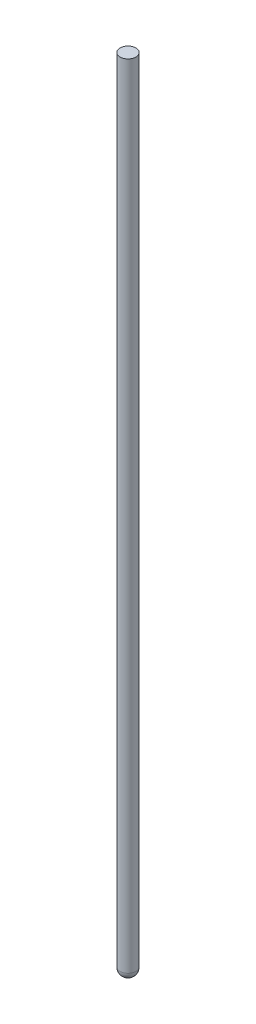
ISO-10303-21;
HEADER;
FILE_DESCRIPTION(('STEP AP214'),'2;1');
FILE_NAME('part.step','',(''),(''),'','','');
FILE_SCHEMA(('AUTOMOTIVE_DESIGN { 1 0 10303 214 1 1 1 1 }'));
ENDSEC;
DATA;
#1=APPLICATION_CONTEXT('core data for automotive mechanical design processes');
#2=APPLICATION_PROTOCOL_DEFINITION('international standard','automotive_design',2000,#1);
#3=PRODUCT_CONTEXT('',#1,'mechanical');
#4=PRODUCT('Part','Part','',(#3));
#5=PRODUCT_RELATED_PRODUCT_CATEGORY('part','',(#4));
#6=PRODUCT_DEFINITION_FORMATION('','',#4);
#7=PRODUCT_DEFINITION_CONTEXT('part definition',#1,'design');
#8=PRODUCT_DEFINITION('design','',#6,#7);
#9=PRODUCT_DEFINITION_SHAPE('','',#8);
#10=(LENGTH_UNIT() NAMED_UNIT(*) SI_UNIT(.MILLI.,.METRE.));
#11=(NAMED_UNIT(*) PLANE_ANGLE_UNIT() SI_UNIT($,.RADIAN.));
#12=(NAMED_UNIT(*) SI_UNIT($,.STERADIAN.) SOLID_ANGLE_UNIT());
#13=UNCERTAINTY_MEASURE_WITH_UNIT(LENGTH_MEASURE(1.E-05),#10,'distance_accuracy_value','');
#14=(GEOMETRIC_REPRESENTATION_CONTEXT(3) GLOBAL_UNCERTAINTY_ASSIGNED_CONTEXT((#13)) GLOBAL_UNIT_ASSIGNED_CONTEXT((#10,
#11,#12)) REPRESENTATION_CONTEXT('',''));
#15=CARTESIAN_POINT('',(0.,0.,0.));
#16=DIRECTION('',(0.,0.,1.));
#17=DIRECTION('',(1.,0.,0.));
#18=AXIS2_PLACEMENT_3D('',#15,#16,#17);
#19=CARTESIAN_POINT('',(0.,50.,0.));
#20=DIRECTION('',(0.,-1.,0.));
#21=DIRECTION('',(0.,0.,-1.));
#22=AXIS2_PLACEMENT_3D('',#19,#20,#21);
#23=PLANE('',#22);
#24=CARTESIAN_POINT('',(0.,50.,0.));
#25=DIRECTION('',(0.,1.,0.));
#26=DIRECTION('',(0.,0.,1.));
#27=AXIS2_PLACEMENT_3D('',#24,#25,#26);
#28=CIRCLE('',#27,0.5);
#29=CARTESIAN_POINT('',(0.,50.,0.5));
#30=VERTEX_POINT('',#29);
#31=EDGE_CURVE('E10',#30,#30,#28,.T.);
#32=ORIENTED_EDGE('',*,*,#31,.T.);
#33=EDGE_LOOP('',(#32));
#34=FACE_BOUND('',#33,.T.);
#35=ADVANCED_FACE('F29',(#34),#23,.F.);
#36=CARTESIAN_POINT('',(0.,0.,0.));
#37=DIRECTION('',(0.,1.,0.));
#38=DIRECTION('',(0.,0.,1.));
#39=AXIS2_PLACEMENT_3D('',#36,#37,#38);
#40=CYLINDRICAL_SURFACE('',#39,0.5);
#41=ORIENTED_EDGE('',*,*,#31,.F.);
#42=EDGE_LOOP('',(#41));
#43=FACE_BOUND('',#42,.T.);
#44=CARTESIAN_POINT('',(0.,0.,0.));
#45=DIRECTION('',(0.,1.,0.));
#46=DIRECTION('',(0.,0.,1.));
#47=AXIS2_PLACEMENT_3D('',#44,#45,#46);
#48=CIRCLE('',#47,0.5);
#49=CARTESIAN_POINT('',(0.,0.,0.5));
#50=VERTEX_POINT('',#49);
#51=EDGE_CURVE('E33',#50,#50,#48,.T.);
#52=ORIENTED_EDGE('',*,*,#51,.T.);
#53=EDGE_LOOP('',(#52));
#54=FACE_BOUND('',#53,.T.);
#55=ADVANCED_FACE('F42',(#43,#54),#40,.T.);
#56=CARTESIAN_POINT('',(0.,0.,0.));
#57=DIRECTION('',(0.,0.,1.));
#58=DIRECTION('',(1.,0.,0.));
#59=AXIS2_PLACEMENT_3D('',#56,#57,#58);
#60=SPHERICAL_SURFACE('',#59,0.5);
#61=CARTESIAN_POINT('',(0.,0.,0.));
#62=DIRECTION('',(0.,1.,0.));
#63=DIRECTION('',(0.,0.,1.));
#64=AXIS2_PLACEMENT_3D('',#61,#62,#63);
#65=SPHERICAL_SURFACE('',#64,0.5);
#66=ORIENTED_EDGE('',*,*,#51,.F.);
#67=EDGE_LOOP('',(#66));
#68=FACE_BOUND('',#67,.T.);
#69=ADVANCED_FACE('F31',(#68),#65,.T.);
#70=CLOSED_SHELL('',(#35,#55,#69));
#71=MANIFOLD_SOLID_BREP('B2',#70);
#72=ADVANCED_BREP_SHAPE_REPRESENTATION('',(#18,#71),#14);
#73=SHAPE_DEFINITION_REPRESENTATION(#9,#72);
ENDSEC;
END-ISO-10303-21;
